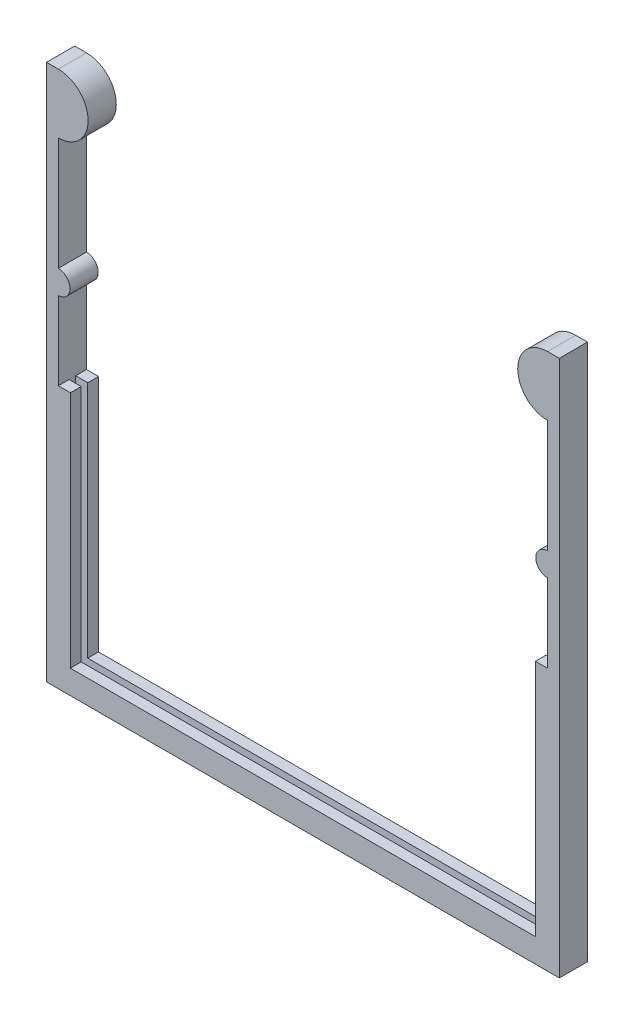
ISO-10303-21;
HEADER;
FILE_DESCRIPTION(('STEP AP214'),'2;1');
FILE_NAME('part.step','',(''),(''),'','','');
FILE_SCHEMA(('AUTOMOTIVE_DESIGN { 1 0 10303 214 1 1 1 1 }'));
ENDSEC;
DATA;
#1=APPLICATION_CONTEXT('core data for automotive mechanical design processes');
#2=APPLICATION_PROTOCOL_DEFINITION('international standard','automotive_design',2000,#1);
#3=PRODUCT_CONTEXT('',#1,'mechanical');
#4=PRODUCT('Part','Part','',(#3));
#5=PRODUCT_RELATED_PRODUCT_CATEGORY('part','',(#4));
#6=PRODUCT_DEFINITION_FORMATION('','',#4);
#7=PRODUCT_DEFINITION_CONTEXT('part definition',#1,'design');
#8=PRODUCT_DEFINITION('design','',#6,#7);
#9=PRODUCT_DEFINITION_SHAPE('','',#8);
#10=(LENGTH_UNIT() NAMED_UNIT(*) SI_UNIT(.MILLI.,.METRE.));
#11=(NAMED_UNIT(*) PLANE_ANGLE_UNIT() SI_UNIT($,.RADIAN.));
#12=(NAMED_UNIT(*) SI_UNIT($,.STERADIAN.) SOLID_ANGLE_UNIT());
#13=UNCERTAINTY_MEASURE_WITH_UNIT(LENGTH_MEASURE(1.E-05),#10,'distance_accuracy_value','');
#14=(GEOMETRIC_REPRESENTATION_CONTEXT(3) GLOBAL_UNCERTAINTY_ASSIGNED_CONTEXT((#13)) GLOBAL_UNIT_ASSIGNED_CONTEXT((#10,
#11,#12)) REPRESENTATION_CONTEXT('',''));
#15=CARTESIAN_POINT('',(0.,0.,0.));
#16=DIRECTION('',(0.,0.,1.));
#17=DIRECTION('',(1.,0.,0.));
#18=AXIS2_PLACEMENT_3D('',#15,#16,#17);
#19=CARTESIAN_POINT('',(-52.1,9.53999999999999,-3.));
#20=DIRECTION('',(0.,1.,0.));
#21=DIRECTION('',(-1.,0.,0.));
#22=AXIS2_PLACEMENT_3D('',#19,#20,#21);
#23=PLANE('',#22);
#24=DIRECTION('',(0.,0.,1.));
#25=VECTOR('',#24,1.);
#26=CARTESIAN_POINT('',(-52.1,9.53999999999999,-3.));
#27=LINE('',#26,#25);
#28=CARTESIAN_POINT('',(-52.1,9.53999999999999,-3.));
#29=VERTEX_POINT('',#28);
#30=CARTESIAN_POINT('',(-52.1,9.53999999999999,-0.7));
#31=VERTEX_POINT('',#30);
#32=EDGE_CURVE('E226',#29,#31,#27,.T.);
#33=ORIENTED_EDGE('',*,*,#32,.T.);
#34=DIRECTION('',(-1.,0.,0.));
#35=VECTOR('',#34,1.);
#36=CARTESIAN_POINT('',(52.1,9.53999999999999,-0.7));
#37=LINE('',#36,#35);
#38=CARTESIAN_POINT('',(-49.53,9.53999999999992,-0.7));
#39=VERTEX_POINT('',#38);
#40=EDGE_CURVE('E211',#39,#31,#37,.T.);
#41=ORIENTED_EDGE('',*,*,#40,.F.);
#42=DIRECTION('',(0.,0.,1.));
#43=VECTOR('',#42,1.);
#44=CARTESIAN_POINT('',(-49.53,9.53999999999999,-3.));
#45=LINE('',#44,#43);
#46=CARTESIAN_POINT('',(-49.53,9.53999999999999,-3.));
#47=VERTEX_POINT('',#46);
#48=EDGE_CURVE('E240',#47,#39,#45,.T.);
#49=ORIENTED_EDGE('',*,*,#48,.F.);
#50=DIRECTION('',(-1.,0.,0.));
#51=VECTOR('',#50,1.);
#52=CARTESIAN_POINT('',(-52.1,9.53999999999999,-3.));
#53=LINE('',#52,#51);
#54=EDGE_CURVE('E235',#47,#29,#53,.T.);
#55=ORIENTED_EDGE('',*,*,#54,.T.);
#56=EDGE_LOOP('',(#33,#41,#49,#55));
#57=FACE_BOUND('',#56,.T.);
#58=ADVANCED_FACE('F36',(#57),#23,.T.);
#59=CARTESIAN_POINT('',(-49.53,-41.26,-3.));
#60=DIRECTION('',(1.,0.,0.));
#61=DIRECTION('',(0.,1.,0.));
#62=AXIS2_PLACEMENT_3D('',#59,#60,#61);
#63=PLANE('',#62);
#64=ORIENTED_EDGE('',*,*,#48,.T.);
#65=DIRECTION('',(0.,-1.,0.));
#66=VECTOR('',#65,1.);
#67=CARTESIAN_POINT('',(-49.53,-41.26,-0.7));
#68=LINE('',#67,#66);
#69=CARTESIAN_POINT('',(-49.53,-41.26,-0.7));
#70=VERTEX_POINT('',#69);
#71=EDGE_CURVE('E217',#39,#70,#68,.T.);
#72=ORIENTED_EDGE('',*,*,#71,.T.);
#73=DIRECTION('',(0.,0.,1.));
#74=VECTOR('',#73,1.);
#75=CARTESIAN_POINT('',(-49.53,-41.26,-3.));
#76=LINE('',#75,#74);
#77=CARTESIAN_POINT('',(-49.53,-41.26,-3.));
#78=VERTEX_POINT('',#77);
#79=EDGE_CURVE('E245',#78,#70,#76,.T.);
#80=ORIENTED_EDGE('',*,*,#79,.F.);
#81=DIRECTION('',(0.,1.,0.));
#82=VECTOR('',#81,1.);
#83=CARTESIAN_POINT('',(-49.53,-41.26,-3.));
#84=LINE('',#83,#82);
#85=EDGE_CURVE('E343',#78,#47,#84,.T.);
#86=ORIENTED_EDGE('',*,*,#85,.T.);
#87=EDGE_LOOP('',(#64,#72,#80,#86));
#88=FACE_BOUND('',#87,.T.);
#89=ADVANCED_FACE('F448',(#88),#63,.T.);
#90=CARTESIAN_POINT('',(49.53,-41.26,-3.));
#91=DIRECTION('',(0.,1.,0.));
#92=DIRECTION('',(0.,0.,1.));
#93=AXIS2_PLACEMENT_3D('',#90,#91,#92);
#94=PLANE('',#93);
#95=ORIENTED_EDGE('',*,*,#79,.T.);
#96=DIRECTION('',(1.,0.,0.));
#97=VECTOR('',#96,1.);
#98=CARTESIAN_POINT('',(49.53,-41.26,-0.7));
#99=LINE('',#98,#97);
#100=CARTESIAN_POINT('',(49.53,-41.26,-0.7));
#101=VERTEX_POINT('',#100);
#102=EDGE_CURVE('E427',#70,#101,#99,.T.);
#103=ORIENTED_EDGE('',*,*,#102,.T.);
#104=DIRECTION('',(0.,0.,1.));
#105=VECTOR('',#104,1.);
#106=CARTESIAN_POINT('',(49.53,-41.26,-3.));
#107=LINE('',#106,#105);
#108=CARTESIAN_POINT('',(49.53,-41.26,-3.));
#109=VERTEX_POINT('',#108);
#110=EDGE_CURVE('E249',#109,#101,#107,.T.);
#111=ORIENTED_EDGE('',*,*,#110,.F.);
#112=DIRECTION('',(-1.,0.,0.));
#113=VECTOR('',#112,1.);
#114=CARTESIAN_POINT('',(49.53,-41.26,-3.));
#115=LINE('',#114,#113);
#116=EDGE_CURVE('E340',#109,#78,#115,.T.);
#117=ORIENTED_EDGE('',*,*,#116,.T.);
#118=EDGE_LOOP('',(#95,#103,#111,#117));
#119=FACE_BOUND('',#118,.T.);
#120=ADVANCED_FACE('F454',(#119),#94,.T.);
#121=CARTESIAN_POINT('',(49.53,-41.26,-3.));
#122=DIRECTION('',(-1.,0.,0.));
#123=DIRECTION('',(0.,-1.,0.));
#124=AXIS2_PLACEMENT_3D('',#121,#122,#123);
#125=PLANE('',#124);
#126=ORIENTED_EDGE('',*,*,#110,.T.);
#127=DIRECTION('',(0.,1.,0.));
#128=VECTOR('',#127,1.);
#129=CARTESIAN_POINT('',(49.53,-41.26,-0.7));
#130=LINE('',#129,#128);
#131=CARTESIAN_POINT('',(49.53,9.53999999999999,-0.7));
#132=VERTEX_POINT('',#131);
#133=EDGE_CURVE('E424',#101,#132,#130,.T.);
#134=ORIENTED_EDGE('',*,*,#133,.T.);
#135=DIRECTION('',(0.,0.,1.));
#136=VECTOR('',#135,1.);
#137=CARTESIAN_POINT('',(49.53,9.53999999999999,-3.));
#138=LINE('',#137,#136);
#139=CARTESIAN_POINT('',(49.53,9.53999999999999,-3.));
#140=VERTEX_POINT('',#139);
#141=EDGE_CURVE('E253',#140,#132,#138,.T.);
#142=ORIENTED_EDGE('',*,*,#141,.F.);
#143=DIRECTION('',(0.,-1.,0.));
#144=VECTOR('',#143,1.);
#145=CARTESIAN_POINT('',(49.53,-41.26,-3.));
#146=LINE('',#145,#144);
#147=EDGE_CURVE('E337',#140,#109,#146,.T.);
#148=ORIENTED_EDGE('',*,*,#147,.T.);
#149=EDGE_LOOP('',(#126,#134,#142,#148));
#150=FACE_BOUND('',#149,.T.);
#151=ADVANCED_FACE('F582',(#150),#125,.T.);
#152=CARTESIAN_POINT('',(52.1,9.53999999999999,-3.));
#153=DIRECTION('',(0.,1.,0.));
#154=DIRECTION('',(-1.,0.,0.));
#155=AXIS2_PLACEMENT_3D('',#152,#153,#154);
#156=PLANE('',#155);
#157=ORIENTED_EDGE('',*,*,#141,.T.);
#158=CARTESIAN_POINT('',(52.1,9.53999999999999,-0.7));
#159=VERTEX_POINT('',#158);
#160=EDGE_CURVE('E221',#159,#132,#37,.T.);
#161=ORIENTED_EDGE('',*,*,#160,.F.);
#162=DIRECTION('',(0.,0.,1.));
#163=VECTOR('',#162,1.);
#164=CARTESIAN_POINT('',(52.1,9.53999999999999,-3.));
#165=LINE('',#164,#163);
#166=CARTESIAN_POINT('',(52.1,9.53999999999999,-3.));
#167=VERTEX_POINT('',#166);
#168=EDGE_CURVE('E257',#167,#159,#165,.T.);
#169=ORIENTED_EDGE('',*,*,#168,.F.);
#170=DIRECTION('',(-1.,0.,0.));
#171=VECTOR('',#170,1.);
#172=CARTESIAN_POINT('',(52.1,9.53999999999999,-3.));
#173=LINE('',#172,#171);
#174=EDGE_CURVE('E334',#167,#140,#173,.T.);
#175=ORIENTED_EDGE('',*,*,#174,.T.);
#176=EDGE_LOOP('',(#157,#161,#169,#175));
#177=FACE_BOUND('',#176,.T.);
#178=ADVANCED_FACE('F576',(#177),#156,.T.);
#179=CARTESIAN_POINT('',(-52.1,61.61,-3.));
#180=DIRECTION('',(0.,0.,1.));
#181=DIRECTION('',(1.,0.,0.));
#182=AXIS2_PLACEMENT_3D('',#179,#180,#181);
#183=CYLINDRICAL_SURFACE('',#182,6.35);
#184=DIRECTION('',(0.,0.,1.));
#185=VECTOR('',#184,1.);
#186=CARTESIAN_POINT('',(-52.1,67.96,-3.));
#187=LINE('',#186,#185);
#188=CARTESIAN_POINT('',(-52.1,67.96,-3.));
#189=VERTEX_POINT('',#188);
#190=CARTESIAN_POINT('',(-52.1,67.96,3.));
#191=VERTEX_POINT('',#190);
#192=EDGE_CURVE('E40',#189,#191,#187,.T.);
#193=ORIENTED_EDGE('',*,*,#192,.T.);
#194=CARTESIAN_POINT('',(-52.1,61.61,3.));
#195=DIRECTION('',(0.,0.,1.));
#196=DIRECTION('',(-1.,0.,0.));
#197=AXIS2_PLACEMENT_3D('',#194,#195,#196);
#198=CIRCLE('',#197,6.35);
#199=CARTESIAN_POINT('',(-52.1,55.26,3.));
#200=VERTEX_POINT('',#199);
#201=EDGE_CURVE('E352',#200,#191,#198,.T.);
#202=ORIENTED_EDGE('',*,*,#201,.F.);
#203=DIRECTION('',(0.,0.,1.));
#204=VECTOR('',#203,1.);
#205=CARTESIAN_POINT('',(-52.1,55.26,-3.));
#206=LINE('',#205,#204);
#207=CARTESIAN_POINT('',(-52.1,55.26,-3.));
#208=VERTEX_POINT('',#207);
#209=EDGE_CURVE('E11',#208,#200,#206,.T.);
#210=ORIENTED_EDGE('',*,*,#209,.F.);
#211=CARTESIAN_POINT('',(-52.1,61.61,-3.));
#212=DIRECTION('',(0.,0.,1.));
#213=DIRECTION('',(-1.,0.,0.));
#214=AXIS2_PLACEMENT_3D('',#211,#212,#213);
#215=CIRCLE('',#214,6.35);
#216=EDGE_CURVE('E306',#208,#189,#215,.T.);
#217=ORIENTED_EDGE('',*,*,#216,.T.);
#218=EDGE_LOOP('',(#193,#202,#210,#217));
#219=FACE_BOUND('',#218,.T.);
#220=ADVANCED_FACE('F38',(#219),#183,.T.);
#221=CARTESIAN_POINT('',(-52.1,43.8,-3.));
#222=DIRECTION('',(1.,0.,0.));
#223=DIRECTION('',(0.,1.,0.));
#224=AXIS2_PLACEMENT_3D('',#221,#222,#223);
#225=PLANE('',#224);
#226=ORIENTED_EDGE('',*,*,#209,.T.);
#227=DIRECTION('',(0.,1.,0.));
#228=VECTOR('',#227,1.);
#229=CARTESIAN_POINT('',(-52.1,31.2,3.));
#230=LINE('',#229,#228);
#231=CARTESIAN_POINT('',(-52.1,31.2,3.));
#232=VERTEX_POINT('',#231);
#233=EDGE_CURVE('E300',#232,#200,#230,.T.);
#234=ORIENTED_EDGE('',*,*,#233,.F.);
#235=DIRECTION('',(0.,0.,1.));
#236=VECTOR('',#235,1.);
#237=CARTESIAN_POINT('',(-52.1,31.2,-3.));
#238=LINE('',#237,#236);
#239=CARTESIAN_POINT('',(-52.1,31.2,-3.));
#240=VERTEX_POINT('',#239);
#241=EDGE_CURVE('E45',#240,#232,#238,.T.);
#242=ORIENTED_EDGE('',*,*,#241,.F.);
#243=DIRECTION('',(0.,1.,0.));
#244=VECTOR('',#243,1.);
#245=CARTESIAN_POINT('',(-52.1,31.2,-3.));
#246=LINE('',#245,#244);
#247=EDGE_CURVE('E60',#240,#208,#246,.T.);
#248=ORIENTED_EDGE('',*,*,#247,.T.);
#249=EDGE_LOOP('',(#226,#234,#242,#248));
#250=FACE_BOUND('',#249,.T.);
#251=ADVANCED_FACE('F305',(#250),#225,.T.);
#252=CARTESIAN_POINT('',(-52.1,28.7,-3.));
#253=DIRECTION('',(0.,0.,1.));
#254=DIRECTION('',(1.,0.,0.));
#255=AXIS2_PLACEMENT_3D('',#252,#253,#254);
#256=CYLINDRICAL_SURFACE('',#255,2.5);
#257=ORIENTED_EDGE('',*,*,#241,.T.);
#258=CARTESIAN_POINT('',(-52.1,28.7,3.));
#259=DIRECTION('',(0.,0.,1.));
#260=DIRECTION('',(-1.,0.,0.));
#261=AXIS2_PLACEMENT_3D('',#258,#259,#260);
#262=CIRCLE('',#261,2.5);
#263=CARTESIAN_POINT('',(-52.1,26.2,3.));
#264=VERTEX_POINT('',#263);
#265=EDGE_CURVE('E292',#264,#232,#262,.T.);
#266=ORIENTED_EDGE('',*,*,#265,.F.);
#267=DIRECTION('',(0.,0.,1.));
#268=VECTOR('',#267,1.);
#269=CARTESIAN_POINT('',(-52.1,26.2,-3.));
#270=LINE('',#269,#268);
#271=CARTESIAN_POINT('',(-52.1,26.2,-3.));
#272=VERTEX_POINT('',#271);
#273=EDGE_CURVE('E236',#272,#264,#270,.T.);
#274=ORIENTED_EDGE('',*,*,#273,.F.);
#275=CARTESIAN_POINT('',(-52.1,28.7,-3.));
#276=DIRECTION('',(0.,0.,1.));
#277=DIRECTION('',(-1.,0.,0.));
#278=AXIS2_PLACEMENT_3D('',#275,#276,#277);
#279=CIRCLE('',#278,2.5);
#280=EDGE_CURVE('E282',#272,#240,#279,.T.);
#281=ORIENTED_EDGE('',*,*,#280,.T.);
#282=EDGE_LOOP('',(#257,#266,#274,#281));
#283=FACE_BOUND('',#282,.T.);
#284=ADVANCED_FACE('F291',(#283),#256,.T.);
#285=CARTESIAN_POINT('',(-52.1,9.53999999999999,-3.));
#286=DIRECTION('',(1.,0.,0.));
#287=DIRECTION('',(0.,0.,-1.));
#288=AXIS2_PLACEMENT_3D('',#285,#286,#287);
#289=PLANE('',#288);
#290=ORIENTED_EDGE('',*,*,#273,.T.);
#291=DIRECTION('',(0.,1.,0.));
#292=VECTOR('',#291,1.);
#293=CARTESIAN_POINT('',(-52.1,9.53999999999999,3.));
#294=LINE('',#293,#292);
#295=CARTESIAN_POINT('',(-52.1,9.53999999999999,3.));
#296=VERTEX_POINT('',#295);
#297=EDGE_CURVE('E303',#296,#264,#294,.T.);
#298=ORIENTED_EDGE('',*,*,#297,.F.);
#299=CARTESIAN_POINT('',(-52.1,9.53999999999999,0.7));
#300=VERTEX_POINT('',#299);
#301=EDGE_CURVE('E237',#300,#296,#27,.T.);
#302=ORIENTED_EDGE('',*,*,#301,.F.);
#303=DIRECTION('',(0.,-1.,0.));
#304=VECTOR('',#303,1.);
#305=CARTESIAN_POINT('',(-52.1,9.53999999999999,0.7));
#306=LINE('',#305,#304);
#307=CARTESIAN_POINT('',(-52.1,-43.8,0.7));
#308=VERTEX_POINT('',#307);
#309=EDGE_CURVE('E403',#300,#308,#306,.T.);
#310=ORIENTED_EDGE('',*,*,#309,.T.);
#311=DIRECTION('',(0.,0.,-1.));
#312=VECTOR('',#311,1.);
#313=CARTESIAN_POINT('',(-52.1,-43.8,0.7));
#314=LINE('',#313,#312);
#315=CARTESIAN_POINT('',(-52.1,-43.8,-0.7));
#316=VERTEX_POINT('',#315);
#317=EDGE_CURVE('E229',#308,#316,#314,.T.);
#318=ORIENTED_EDGE('',*,*,#317,.T.);
#319=DIRECTION('',(0.,-1.,0.));
#320=VECTOR('',#319,1.);
#321=CARTESIAN_POINT('',(-52.1,9.53999999999999,-0.7));
#322=LINE('',#321,#320);
#323=EDGE_CURVE('E215',#31,#316,#322,.T.);
#324=ORIENTED_EDGE('',*,*,#323,.F.);
#325=ORIENTED_EDGE('',*,*,#32,.F.);
#326=DIRECTION('',(0.,1.,0.));
#327=VECTOR('',#326,1.);
#328=CARTESIAN_POINT('',(-52.1,9.53999999999999,-3.));
#329=LINE('',#328,#327);
#330=EDGE_CURVE('E285',#29,#272,#329,.T.);
#331=ORIENTED_EDGE('',*,*,#330,.T.);
#332=EDGE_LOOP('',(#290,#298,#302,#310,#318,#324,#325,#331));
#333=FACE_BOUND('',#332,.T.);
#334=ADVANCED_FACE('F224',(#333),#289,.T.);
#335=DIRECTION('',(-1.,0.,0.));
#336=VECTOR('',#335,1.);
#337=CARTESIAN_POINT('',(52.1,9.53999999999999,0.7));
#338=LINE('',#337,#336);
#339=CARTESIAN_POINT('',(-49.53,9.53999999999992,0.7));
#340=VERTEX_POINT('',#339);
#341=EDGE_CURVE('E406',#340,#300,#338,.T.);
#342=ORIENTED_EDGE('',*,*,#341,.T.);
#343=ORIENTED_EDGE('',*,*,#301,.T.);
#344=DIRECTION('',(-1.,0.,0.));
#345=VECTOR('',#344,1.);
#346=CARTESIAN_POINT('',(-52.1,9.53999999999999,3.));
#347=LINE('',#346,#345);
#348=CARTESIAN_POINT('',(-49.53,9.53999999999999,3.));
#349=VERTEX_POINT('',#348);
#350=EDGE_CURVE('E397',#349,#296,#347,.T.);
#351=ORIENTED_EDGE('',*,*,#350,.F.);
#352=EDGE_CURVE('E244',#340,#349,#45,.T.);
#353=ORIENTED_EDGE('',*,*,#352,.F.);
#354=EDGE_LOOP('',(#342,#343,#351,#353));
#355=FACE_BOUND('',#354,.T.);
#356=ADVANCED_FACE('F405',(#355),#23,.T.);
#357=DIRECTION('',(0.,-1.,0.));
#358=VECTOR('',#357,1.);
#359=CARTESIAN_POINT('',(-49.53,-41.26,0.7));
#360=LINE('',#359,#358);
#361=CARTESIAN_POINT('',(-49.53,-41.26,0.7));
#362=VERTEX_POINT('',#361);
#363=EDGE_CURVE('E354',#340,#362,#360,.T.);
#364=ORIENTED_EDGE('',*,*,#363,.F.);
#365=ORIENTED_EDGE('',*,*,#352,.T.);
#366=DIRECTION('',(0.,1.,0.));
#367=VECTOR('',#366,1.);
#368=CARTESIAN_POINT('',(-49.53,-41.26,3.));
#369=LINE('',#368,#367);
#370=CARTESIAN_POINT('',(-49.53,-41.26,3.));
#371=VERTEX_POINT('',#370);
#372=EDGE_CURVE('E394',#371,#349,#369,.T.);
#373=ORIENTED_EDGE('',*,*,#372,.F.);
#374=EDGE_CURVE('E248',#362,#371,#76,.T.);
#375=ORIENTED_EDGE('',*,*,#374,.F.);
#376=EDGE_LOOP('',(#364,#365,#373,#375));
#377=FACE_BOUND('',#376,.T.);
#378=ADVANCED_FACE('F445',(#377),#63,.T.);
#379=DIRECTION('',(1.,0.,0.));
#380=VECTOR('',#379,1.);
#381=CARTESIAN_POINT('',(49.53,-41.26,0.7));
#382=LINE('',#381,#380);
#383=CARTESIAN_POINT('',(49.53,-41.26,0.7));
#384=VERTEX_POINT('',#383);
#385=EDGE_CURVE('E358',#362,#384,#382,.T.);
#386=ORIENTED_EDGE('',*,*,#385,.F.);
#387=ORIENTED_EDGE('',*,*,#374,.T.);
#388=DIRECTION('',(-1.,0.,0.));
#389=VECTOR('',#388,1.);
#390=CARTESIAN_POINT('',(49.53,-41.26,3.));
#391=LINE('',#390,#389);
#392=CARTESIAN_POINT('',(49.53,-41.26,3.));
#393=VERTEX_POINT('',#392);
#394=EDGE_CURVE('E391',#393,#371,#391,.T.);
#395=ORIENTED_EDGE('',*,*,#394,.F.);
#396=EDGE_CURVE('E252',#384,#393,#107,.T.);
#397=ORIENTED_EDGE('',*,*,#396,.F.);
#398=EDGE_LOOP('',(#386,#387,#395,#397));
#399=FACE_BOUND('',#398,.T.);
#400=ADVANCED_FACE('F443',(#399),#94,.T.);
#401=DIRECTION('',(0.,1.,0.));
#402=VECTOR('',#401,1.);
#403=CARTESIAN_POINT('',(49.53,-41.26,0.7));
#404=LINE('',#403,#402);
#405=CARTESIAN_POINT('',(49.53,9.53999999999999,0.7));
#406=VERTEX_POINT('',#405);
#407=EDGE_CURVE('E431',#384,#406,#404,.T.);
#408=ORIENTED_EDGE('',*,*,#407,.F.);
#409=ORIENTED_EDGE('',*,*,#396,.T.);
#410=DIRECTION('',(0.,-1.,0.));
#411=VECTOR('',#410,1.);
#412=CARTESIAN_POINT('',(49.53,-41.26,3.));
#413=LINE('',#412,#411);
#414=CARTESIAN_POINT('',(49.53,9.53999999999999,3.));
#415=VERTEX_POINT('',#414);
#416=EDGE_CURVE('E388',#415,#393,#413,.T.);
#417=ORIENTED_EDGE('',*,*,#416,.F.);
#418=EDGE_CURVE('E256',#406,#415,#138,.T.);
#419=ORIENTED_EDGE('',*,*,#418,.F.);
#420=EDGE_LOOP('',(#408,#409,#417,#419));
#421=FACE_BOUND('',#420,.T.);
#422=ADVANCED_FACE('F440',(#421),#125,.T.);
#423=CARTESIAN_POINT('',(52.1,9.53999999999999,0.7));
#424=VERTEX_POINT('',#423);
#425=EDGE_CURVE('E409',#424,#406,#338,.T.);
#426=ORIENTED_EDGE('',*,*,#425,.T.);
#427=ORIENTED_EDGE('',*,*,#418,.T.);
#428=DIRECTION('',(-1.,0.,0.));
#429=VECTOR('',#428,1.);
#430=CARTESIAN_POINT('',(52.1,9.53999999999999,3.));
#431=LINE('',#430,#429);
#432=CARTESIAN_POINT('',(52.1,9.53999999999999,3.));
#433=VERTEX_POINT('',#432);
#434=EDGE_CURVE('E385',#433,#415,#431,.T.);
#435=ORIENTED_EDGE('',*,*,#434,.F.);
#436=EDGE_CURVE('E260',#424,#433,#165,.T.);
#437=ORIENTED_EDGE('',*,*,#436,.F.);
#438=EDGE_LOOP('',(#426,#427,#435,#437));
#439=FACE_BOUND('',#438,.T.);
#440=ADVANCED_FACE('F567',(#439),#156,.T.);
#441=CARTESIAN_POINT('',(52.1,9.53999999999999,-3.));
#442=DIRECTION('',(-1.,0.,0.));
#443=DIRECTION('',(0.,0.,1.));
#444=AXIS2_PLACEMENT_3D('',#441,#442,#443);
#445=PLANE('',#444);
#446=ORIENTED_EDGE('',*,*,#168,.T.);
#447=DIRECTION('',(0.,-1.,0.));
#448=VECTOR('',#447,1.);
#449=CARTESIAN_POINT('',(52.1,9.53999999999999,-0.7));
#450=LINE('',#449,#448);
#451=CARTESIAN_POINT('',(52.1,-43.8,-0.7));
#452=VERTEX_POINT('',#451);
#453=EDGE_CURVE('E410',#159,#452,#450,.T.);
#454=ORIENTED_EDGE('',*,*,#453,.T.);
#455=DIRECTION('',(0.,0.,-1.));
#456=VECTOR('',#455,1.);
#457=CARTESIAN_POINT('',(52.1,-43.8,0.7));
#458=LINE('',#457,#456);
#459=CARTESIAN_POINT('',(52.1,-43.8,0.7));
#460=VERTEX_POINT('',#459);
#461=EDGE_CURVE('E421',#460,#452,#458,.T.);
#462=ORIENTED_EDGE('',*,*,#461,.F.);
#463=DIRECTION('',(0.,-1.,0.));
#464=VECTOR('',#463,1.);
#465=CARTESIAN_POINT('',(52.1,9.53999999999999,0.7));
#466=LINE('',#465,#464);
#467=EDGE_CURVE('E53',#424,#460,#466,.T.);
#468=ORIENTED_EDGE('',*,*,#467,.F.);
#469=ORIENTED_EDGE('',*,*,#436,.T.);
#470=DIRECTION('',(0.,-1.,0.));
#471=VECTOR('',#470,1.);
#472=CARTESIAN_POINT('',(52.1,9.53999999999999,3.));
#473=LINE('',#472,#471);
#474=CARTESIAN_POINT('',(52.1,26.2,3.));
#475=VERTEX_POINT('',#474);
#476=EDGE_CURVE('E382',#475,#433,#473,.T.);
#477=ORIENTED_EDGE('',*,*,#476,.F.);
#478=DIRECTION('',(0.,0.,1.));
#479=VECTOR('',#478,1.);
#480=CARTESIAN_POINT('',(52.1,26.2,-3.));
#481=LINE('',#480,#479);
#482=CARTESIAN_POINT('',(52.1,26.2,-3.));
#483=VERTEX_POINT('',#482);
#484=EDGE_CURVE('E261',#483,#475,#481,.T.);
#485=ORIENTED_EDGE('',*,*,#484,.F.);
#486=DIRECTION('',(0.,-1.,0.));
#487=VECTOR('',#486,1.);
#488=CARTESIAN_POINT('',(52.1,9.53999999999999,-3.));
#489=LINE('',#488,#487);
#490=EDGE_CURVE('E331',#483,#167,#489,.T.);
#491=ORIENTED_EDGE('',*,*,#490,.T.);
#492=EDGE_LOOP('',(#446,#454,#462,#468,#469,#477,#485,#491));
#493=FACE_BOUND('',#492,.T.);
#494=ADVANCED_FACE('F559',(#493),#445,.T.);
#495=CARTESIAN_POINT('',(52.1,28.7,-3.));
#496=DIRECTION('',(0.,0.,1.));
#497=DIRECTION('',(1.,0.,0.));
#498=AXIS2_PLACEMENT_3D('',#495,#496,#497);
#499=CYLINDRICAL_SURFACE('',#498,2.5);
#500=ORIENTED_EDGE('',*,*,#484,.T.);
#501=CARTESIAN_POINT('',(52.1,28.7,3.));
#502=DIRECTION('',(0.,0.,1.));
#503=DIRECTION('',(1.,0.,0.));
#504=AXIS2_PLACEMENT_3D('',#501,#502,#503);
#505=CIRCLE('',#504,2.5);
#506=CARTESIAN_POINT('',(52.1,31.2,3.));
#507=VERTEX_POINT('',#506);
#508=EDGE_CURVE('E379',#507,#475,#505,.T.);
#509=ORIENTED_EDGE('',*,*,#508,.F.);
#510=DIRECTION('',(0.,0.,1.));
#511=VECTOR('',#510,1.);
#512=CARTESIAN_POINT('',(52.1,31.2,-3.));
#513=LINE('',#512,#511);
#514=CARTESIAN_POINT('',(52.1,31.2,-3.));
#515=VERTEX_POINT('',#514);
#516=EDGE_CURVE('E263',#515,#507,#513,.T.);
#517=ORIENTED_EDGE('',*,*,#516,.F.);
#518=CARTESIAN_POINT('',(52.1,28.7,-3.));
#519=DIRECTION('',(0.,0.,1.));
#520=DIRECTION('',(1.,0.,0.));
#521=AXIS2_PLACEMENT_3D('',#518,#519,#520);
#522=CIRCLE('',#521,2.5);
#523=EDGE_CURVE('E328',#515,#483,#522,.T.);
#524=ORIENTED_EDGE('',*,*,#523,.T.);
#525=EDGE_LOOP('',(#500,#509,#517,#524));
#526=FACE_BOUND('',#525,.T.);
#527=ADVANCED_FACE('F551',(#526),#499,.T.);
#528=CARTESIAN_POINT('',(52.1,31.2,-3.));
#529=DIRECTION('',(-1.,0.,0.));
#530=DIRECTION('',(0.,0.,1.));
#531=AXIS2_PLACEMENT_3D('',#528,#529,#530);
#532=PLANE('',#531);
#533=ORIENTED_EDGE('',*,*,#516,.T.);
#534=DIRECTION('',(0.,-1.,0.));
#535=VECTOR('',#534,1.);
#536=CARTESIAN_POINT('',(52.1,43.8,3.));
#537=LINE('',#536,#535);
#538=CARTESIAN_POINT('',(52.1,55.26,3.));
#539=VERTEX_POINT('',#538);
#540=EDGE_CURVE('E376',#539,#507,#537,.T.);
#541=ORIENTED_EDGE('',*,*,#540,.F.);
#542=DIRECTION('',(0.,0.,1.));
#543=VECTOR('',#542,1.);
#544=CARTESIAN_POINT('',(52.1,55.26,-3.));
#545=LINE('',#544,#543);
#546=CARTESIAN_POINT('',(52.1,55.26,-3.));
#547=VERTEX_POINT('',#546);
#548=EDGE_CURVE('E265',#547,#539,#545,.T.);
#549=ORIENTED_EDGE('',*,*,#548,.F.);
#550=DIRECTION('',(0.,-1.,0.));
#551=VECTOR('',#550,1.);
#552=CARTESIAN_POINT('',(52.1,43.8,-3.));
#553=LINE('',#552,#551);
#554=EDGE_CURVE('E326',#547,#515,#553,.T.);
#555=ORIENTED_EDGE('',*,*,#554,.T.);
#556=EDGE_LOOP('',(#533,#541,#549,#555));
#557=FACE_BOUND('',#556,.T.);
#558=ADVANCED_FACE('F543',(#557),#532,.T.);
#559=CARTESIAN_POINT('',(52.1,61.61,-3.));
#560=DIRECTION('',(0.,0.,1.));
#561=DIRECTION('',(1.,0.,0.));
#562=AXIS2_PLACEMENT_3D('',#559,#560,#561);
#563=CYLINDRICAL_SURFACE('',#562,6.35);
#564=ORIENTED_EDGE('',*,*,#548,.T.);
#565=CARTESIAN_POINT('',(52.1,61.61,3.));
#566=DIRECTION('',(0.,0.,1.));
#567=DIRECTION('',(1.,0.,0.));
#568=AXIS2_PLACEMENT_3D('',#565,#566,#567);
#569=CIRCLE('',#568,6.35);
#570=CARTESIAN_POINT('',(52.1,67.96,3.));
#571=VERTEX_POINT('',#570);
#572=EDGE_CURVE('E373',#571,#539,#569,.T.);
#573=ORIENTED_EDGE('',*,*,#572,.F.);
#574=DIRECTION('',(0.,0.,1.));
#575=VECTOR('',#574,1.);
#576=CARTESIAN_POINT('',(52.1,67.96,-3.));
#577=LINE('',#576,#575);
#578=CARTESIAN_POINT('',(52.1,67.96,-3.));
#579=VERTEX_POINT('',#578);
#580=EDGE_CURVE('E267',#579,#571,#577,.T.);
#581=ORIENTED_EDGE('',*,*,#580,.F.);
#582=CARTESIAN_POINT('',(52.1,61.61,-3.));
#583=DIRECTION('',(0.,0.,1.));
#584=DIRECTION('',(1.,0.,0.));
#585=AXIS2_PLACEMENT_3D('',#582,#583,#584);
#586=CIRCLE('',#585,6.35);
#587=EDGE_CURVE('E323',#579,#547,#586,.T.);
#588=ORIENTED_EDGE('',*,*,#587,.T.);
#589=EDGE_LOOP('',(#564,#573,#581,#588));
#590=FACE_BOUND('',#589,.T.);
#591=ADVANCED_FACE('F535',(#590),#563,.T.);
#592=CARTESIAN_POINT('',(52.1,67.96,-3.));
#593=DIRECTION('',(0.,1.,0.));
#594=DIRECTION('',(0.,0.,1.));
#595=AXIS2_PLACEMENT_3D('',#592,#593,#594);
#596=PLANE('',#595);
#597=ORIENTED_EDGE('',*,*,#580,.T.);
#598=DIRECTION('',(-1.,0.,0.));
#599=VECTOR('',#598,1.);
#600=CARTESIAN_POINT('',(52.1,67.96,3.));
#601=LINE('',#600,#599);
#602=CARTESIAN_POINT('',(54.61,67.96,3.));
#603=VERTEX_POINT('',#602);
#604=EDGE_CURVE('E370',#603,#571,#601,.T.);
#605=ORIENTED_EDGE('',*,*,#604,.F.);
#606=DIRECTION('',(0.,0.,1.));
#607=VECTOR('',#606,1.);
#608=CARTESIAN_POINT('',(54.61,67.96,-3.));
#609=LINE('',#608,#607);
#610=CARTESIAN_POINT('',(54.61,67.96,-3.));
#611=VERTEX_POINT('',#610);
#612=EDGE_CURVE('E269',#611,#603,#609,.T.);
#613=ORIENTED_EDGE('',*,*,#612,.F.);
#614=DIRECTION('',(-1.,0.,0.));
#615=VECTOR('',#614,1.);
#616=CARTESIAN_POINT('',(52.1,67.96,-3.));
#617=LINE('',#616,#615);
#618=EDGE_CURVE('E320',#611,#579,#617,.T.);
#619=ORIENTED_EDGE('',*,*,#618,.T.);
#620=EDGE_LOOP('',(#597,#605,#613,#619));
#621=FACE_BOUND('',#620,.T.);
#622=ADVANCED_FACE('F527',(#621),#596,.T.);
#623=CARTESIAN_POINT('',(54.61,9.92923000912062,-3.));
#624=DIRECTION('',(1.,0.,0.));
#625=DIRECTION('',(0.,0.,-1.));
#626=AXIS2_PLACEMENT_3D('',#623,#624,#625);
#627=PLANE('',#626);
#628=ORIENTED_EDGE('',*,*,#612,.T.);
#629=DIRECTION('',(0.,1.,0.));
#630=VECTOR('',#629,1.);
#631=CARTESIAN_POINT('',(54.61,-46.34,3.));
#632=LINE('',#631,#630);
#633=CARTESIAN_POINT('',(54.61,-46.34,3.));
#634=VERTEX_POINT('',#633);
#635=EDGE_CURVE('E367',#634,#603,#632,.T.);
#636=ORIENTED_EDGE('',*,*,#635,.F.);
#637=DIRECTION('',(0.,0.,1.));
#638=VECTOR('',#637,1.);
#639=CARTESIAN_POINT('',(54.61,-46.34,-3.));
#640=LINE('',#639,#638);
#641=CARTESIAN_POINT('',(54.61,-46.34,-3.));
#642=VERTEX_POINT('',#641);
#643=EDGE_CURVE('E271',#642,#634,#640,.T.);
#644=ORIENTED_EDGE('',*,*,#643,.F.);
#645=DIRECTION('',(0.,1.,0.));
#646=VECTOR('',#645,1.);
#647=CARTESIAN_POINT('',(54.61,-46.34,-3.));
#648=LINE('',#647,#646);
#649=EDGE_CURVE('E318',#642,#611,#648,.T.);
#650=ORIENTED_EDGE('',*,*,#649,.T.);
#651=EDGE_LOOP('',(#628,#636,#644,#650));
#652=FACE_BOUND('',#651,.T.);
#653=ADVANCED_FACE('F519',(#652),#627,.T.);
#654=CARTESIAN_POINT('',(54.61,-46.34,-3.));
#655=DIRECTION('',(0.,-1.,0.));
#656=DIRECTION('',(0.,0.,-1.));
#657=AXIS2_PLACEMENT_3D('',#654,#655,#656);
#658=PLANE('',#657);
#659=ORIENTED_EDGE('',*,*,#643,.T.);
#660=DIRECTION('',(1.,0.,0.));
#661=VECTOR('',#660,1.);
#662=CARTESIAN_POINT('',(54.61,-46.34,3.));
#663=LINE('',#662,#661);
#664=CARTESIAN_POINT('',(-54.61,-46.34,3.));
#665=VERTEX_POINT('',#664);
#666=EDGE_CURVE('E364',#665,#634,#663,.T.);
#667=ORIENTED_EDGE('',*,*,#666,.F.);
#668=DIRECTION('',(0.,0.,1.));
#669=VECTOR('',#668,1.);
#670=CARTESIAN_POINT('',(-54.61,-46.34,-3.));
#671=LINE('',#670,#669);
#672=CARTESIAN_POINT('',(-54.61,-46.34,-3.));
#673=VERTEX_POINT('',#672);
#674=EDGE_CURVE('E273',#673,#665,#671,.T.);
#675=ORIENTED_EDGE('',*,*,#674,.F.);
#676=DIRECTION('',(1.,0.,0.));
#677=VECTOR('',#676,1.);
#678=CARTESIAN_POINT('',(54.61,-46.34,-3.));
#679=LINE('',#678,#677);
#680=EDGE_CURVE('E315',#673,#642,#679,.T.);
#681=ORIENTED_EDGE('',*,*,#680,.T.);
#682=EDGE_LOOP('',(#659,#667,#675,#681));
#683=FACE_BOUND('',#682,.T.);
#684=ADVANCED_FACE('F511',(#683),#658,.T.);
#685=CARTESIAN_POINT('',(-54.61,-46.34,-3.));
#686=DIRECTION('',(-1.,0.,0.));
#687=DIRECTION('',(0.,0.,1.));
#688=AXIS2_PLACEMENT_3D('',#685,#686,#687);
#689=PLANE('',#688);
#690=ORIENTED_EDGE('',*,*,#674,.T.);
#691=DIRECTION('',(0.,-1.,0.));
#692=VECTOR('',#691,1.);
#693=CARTESIAN_POINT('',(-54.61,9.92923000912062,3.));
#694=LINE('',#693,#692);
#695=CARTESIAN_POINT('',(-54.61,67.96,3.));
#696=VERTEX_POINT('',#695);
#697=EDGE_CURVE('E356',#696,#665,#694,.T.);
#698=ORIENTED_EDGE('',*,*,#697,.F.);
#699=DIRECTION('',(0.,0.,1.));
#700=VECTOR('',#699,1.);
#701=CARTESIAN_POINT('',(-54.61,67.96,-3.));
#702=LINE('',#701,#700);
#703=CARTESIAN_POINT('',(-54.61,67.96,-3.));
#704=VERTEX_POINT('',#703);
#705=EDGE_CURVE('E274',#704,#696,#702,.T.);
#706=ORIENTED_EDGE('',*,*,#705,.F.);
#707=DIRECTION('',(0.,-1.,0.));
#708=VECTOR('',#707,1.);
#709=CARTESIAN_POINT('',(-54.61,9.92923000912062,-3.));
#710=LINE('',#709,#708);
#711=EDGE_CURVE('E313',#704,#673,#710,.T.);
#712=ORIENTED_EDGE('',*,*,#711,.T.);
#713=EDGE_LOOP('',(#690,#698,#706,#712));
#714=FACE_BOUND('',#713,.T.);
#715=ADVANCED_FACE('F505',(#714),#689,.T.);
#716=CARTESIAN_POINT('',(-52.1,67.96,-3.));
#717=DIRECTION('',(0.,1.,0.));
#718=DIRECTION('',(0.,0.,1.));
#719=AXIS2_PLACEMENT_3D('',#716,#717,#718);
#720=PLANE('',#719);
#721=ORIENTED_EDGE('',*,*,#705,.T.);
#722=DIRECTION('',(-1.,0.,0.));
#723=VECTOR('',#722,1.);
#724=CARTESIAN_POINT('',(-52.1,67.96,3.));
#725=LINE('',#724,#723);
#726=EDGE_CURVE('E353',#191,#696,#725,.T.);
#727=ORIENTED_EDGE('',*,*,#726,.F.);
#728=ORIENTED_EDGE('',*,*,#192,.F.);
#729=DIRECTION('',(-1.,0.,0.));
#730=VECTOR('',#729,1.);
#731=CARTESIAN_POINT('',(-52.1,67.96,-3.));
#732=LINE('',#731,#730);
#733=EDGE_CURVE('E308',#189,#704,#732,.T.);
#734=ORIENTED_EDGE('',*,*,#733,.T.);
#735=EDGE_LOOP('',(#721,#727,#728,#734));
#736=FACE_BOUND('',#735,.T.);
#737=ADVANCED_FACE('F470',(#736),#720,.T.);
#738=CARTESIAN_POINT('',(-52.1,61.61,-3.));
#739=DIRECTION('',(0.,0.,-1.));
#740=DIRECTION('',(-1.,0.,0.));
#741=AXIS2_PLACEMENT_3D('',#738,#739,#740);
#742=PLANE('',#741);
#743=ORIENTED_EDGE('',*,*,#216,.F.);
#744=ORIENTED_EDGE('',*,*,#247,.F.);
#745=ORIENTED_EDGE('',*,*,#280,.F.);
#746=ORIENTED_EDGE('',*,*,#330,.F.);
#747=ORIENTED_EDGE('',*,*,#54,.F.);
#748=ORIENTED_EDGE('',*,*,#85,.F.);
#749=ORIENTED_EDGE('',*,*,#116,.F.);
#750=ORIENTED_EDGE('',*,*,#147,.F.);
#751=ORIENTED_EDGE('',*,*,#174,.F.);
#752=ORIENTED_EDGE('',*,*,#490,.F.);
#753=ORIENTED_EDGE('',*,*,#523,.F.);
#754=ORIENTED_EDGE('',*,*,#554,.F.);
#755=ORIENTED_EDGE('',*,*,#587,.F.);
#756=ORIENTED_EDGE('',*,*,#618,.F.);
#757=ORIENTED_EDGE('',*,*,#649,.F.);
#758=ORIENTED_EDGE('',*,*,#680,.F.);
#759=ORIENTED_EDGE('',*,*,#711,.F.);
#760=ORIENTED_EDGE('',*,*,#733,.F.);
#761=EDGE_LOOP('',(#743,#744,#745,#746,#747,#748,#749,#750,#751,#752,#753,#754,#755,#756,#757,
#758,#759,#760));
#762=FACE_BOUND('',#761,.T.);
#763=ADVANCED_FACE('F348',(#762),#742,.T.);
#764=CARTESIAN_POINT('',(-52.1,61.61,3.));
#765=DIRECTION('',(0.,0.,-1.));
#766=DIRECTION('',(-1.,0.,0.));
#767=AXIS2_PLACEMENT_3D('',#764,#765,#766);
#768=PLANE('',#767);
#769=ORIENTED_EDGE('',*,*,#201,.T.);
#770=ORIENTED_EDGE('',*,*,#726,.T.);
#771=ORIENTED_EDGE('',*,*,#697,.T.);
#772=ORIENTED_EDGE('',*,*,#666,.T.);
#773=ORIENTED_EDGE('',*,*,#635,.T.);
#774=ORIENTED_EDGE('',*,*,#604,.T.);
#775=ORIENTED_EDGE('',*,*,#572,.T.);
#776=ORIENTED_EDGE('',*,*,#540,.T.);
#777=ORIENTED_EDGE('',*,*,#508,.T.);
#778=ORIENTED_EDGE('',*,*,#476,.T.);
#779=ORIENTED_EDGE('',*,*,#434,.T.);
#780=ORIENTED_EDGE('',*,*,#416,.T.);
#781=ORIENTED_EDGE('',*,*,#394,.T.);
#782=ORIENTED_EDGE('',*,*,#372,.T.);
#783=ORIENTED_EDGE('',*,*,#350,.T.);
#784=ORIENTED_EDGE('',*,*,#297,.T.);
#785=ORIENTED_EDGE('',*,*,#265,.T.);
#786=ORIENTED_EDGE('',*,*,#233,.T.);
#787=EDGE_LOOP('',(#769,#770,#771,#772,#773,#774,#775,#776,#777,#778,#779,#780,#781,#782,#783,
#784,#785,#786));
#788=FACE_BOUND('',#787,.T.);
#789=ADVANCED_FACE('F299',(#788),#768,.F.);
#790=CARTESIAN_POINT('',(-52.1,-43.8,0.7));
#791=DIRECTION('',(0.,1.,0.));
#792=DIRECTION('',(0.,0.,1.));
#793=AXIS2_PLACEMENT_3D('',#790,#791,#792);
#794=PLANE('',#793);
#795=ORIENTED_EDGE('',*,*,#317,.F.);
#796=DIRECTION('',(1.,0.,0.));
#797=VECTOR('',#796,1.);
#798=CARTESIAN_POINT('',(-52.1,-43.8,0.7));
#799=LINE('',#798,#797);
#800=EDGE_CURVE('E418',#308,#460,#799,.T.);
#801=ORIENTED_EDGE('',*,*,#800,.T.);
#802=ORIENTED_EDGE('',*,*,#461,.T.);
#803=DIRECTION('',(1.,0.,0.));
#804=VECTOR('',#803,1.);
#805=CARTESIAN_POINT('',(-52.1,-43.8,-0.7));
#806=LINE('',#805,#804);
#807=EDGE_CURVE('E231',#316,#452,#806,.T.);
#808=ORIENTED_EDGE('',*,*,#807,.F.);
#809=EDGE_LOOP('',(#795,#801,#802,#808));
#810=FACE_BOUND('',#809,.T.);
#811=ADVANCED_FACE('F473',(#810),#794,.T.);
#812=CARTESIAN_POINT('',(0.,0.,0.7));
#813=DIRECTION('',(0.,0.,1.));
#814=DIRECTION('',(1.,0.,0.));
#815=AXIS2_PLACEMENT_3D('',#812,#813,#814);
#816=PLANE('',#815);
#817=ORIENTED_EDGE('',*,*,#363,.T.);
#818=ORIENTED_EDGE('',*,*,#385,.T.);
#819=ORIENTED_EDGE('',*,*,#407,.T.);
#820=ORIENTED_EDGE('',*,*,#425,.F.);
#821=ORIENTED_EDGE('',*,*,#467,.T.);
#822=ORIENTED_EDGE('',*,*,#800,.F.);
#823=ORIENTED_EDGE('',*,*,#309,.F.);
#824=ORIENTED_EDGE('',*,*,#341,.F.);
#825=EDGE_LOOP('',(#817,#818,#819,#820,#821,#822,#823,#824));
#826=FACE_BOUND('',#825,.T.);
#827=ADVANCED_FACE('F434',(#826),#816,.F.);
#828=CARTESIAN_POINT('',(0.,0.,-0.7));
#829=DIRECTION('',(0.,0.,1.));
#830=DIRECTION('',(1.,0.,0.));
#831=AXIS2_PLACEMENT_3D('',#828,#829,#830);
#832=PLANE('',#831);
#833=ORIENTED_EDGE('',*,*,#40,.T.);
#834=ORIENTED_EDGE('',*,*,#323,.T.);
#835=ORIENTED_EDGE('',*,*,#807,.T.);
#836=ORIENTED_EDGE('',*,*,#453,.F.);
#837=ORIENTED_EDGE('',*,*,#160,.T.);
#838=ORIENTED_EDGE('',*,*,#133,.F.);
#839=ORIENTED_EDGE('',*,*,#102,.F.);
#840=ORIENTED_EDGE('',*,*,#71,.F.);
#841=EDGE_LOOP('',(#833,#834,#835,#836,#837,#838,#839,#840));
#842=FACE_BOUND('',#841,.T.);
#843=ADVANCED_FACE('F213',(#842),#832,.T.);
#844=CLOSED_SHELL('',(#58,#89,#120,#151,#178,#220,#251,#284,#334,#356,#378,#400,#422,#440,#494,
#527,#558,#591,#622,#653,#684,#715,#737,#763,#789,#811,#827,#843));
#845=MANIFOLD_SOLID_BREP('B2',#844);
#846=ADVANCED_BREP_SHAPE_REPRESENTATION('',(#18,#845),#14);
#847=SHAPE_DEFINITION_REPRESENTATION(#9,#846);
ENDSEC;
END-ISO-10303-21;
